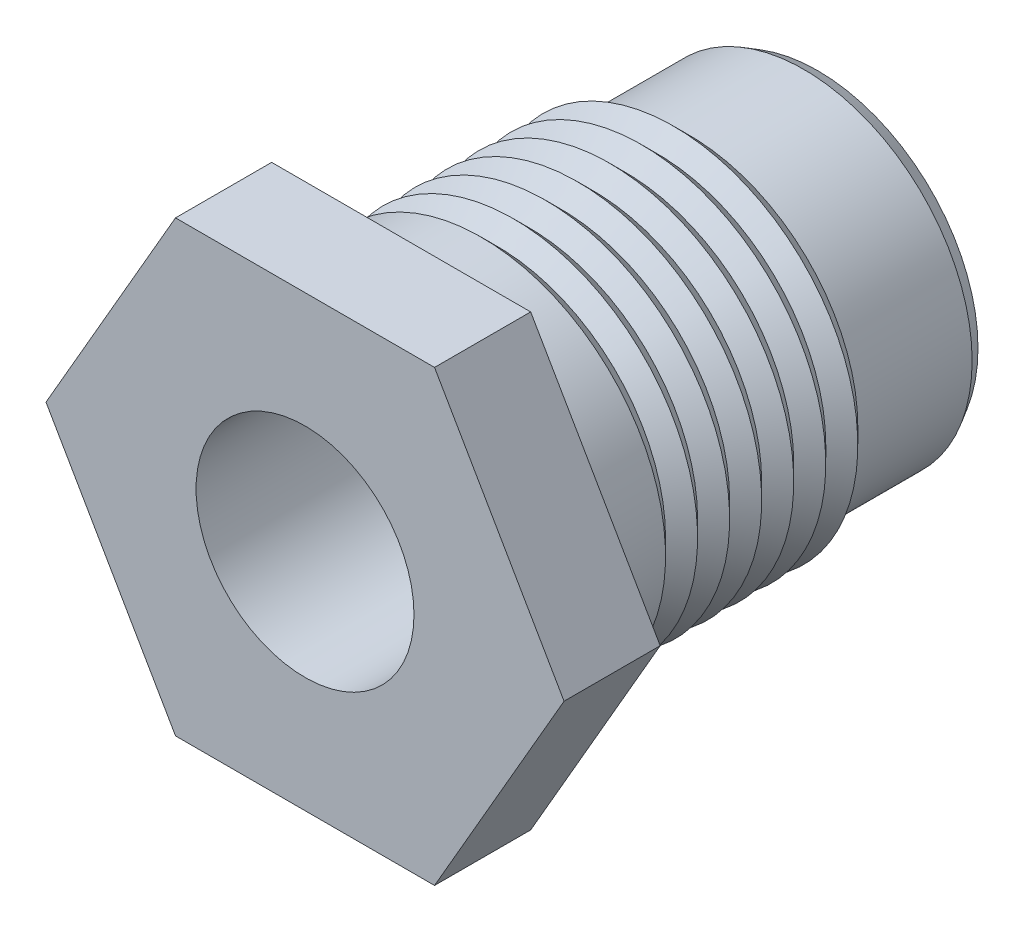
ISO-10303-21;
HEADER;
FILE_DESCRIPTION(('STEP AP214'),'2;1');
FILE_NAME('part.step','',(''),(''),'','','');
FILE_SCHEMA(('AUTOMOTIVE_DESIGN { 1 0 10303 214 1 1 1 1 }'));
ENDSEC;
DATA;
#1=APPLICATION_CONTEXT('core data for automotive mechanical design processes');
#2=APPLICATION_PROTOCOL_DEFINITION('international standard','automotive_design',2000,#1);
#3=PRODUCT_CONTEXT('',#1,'mechanical');
#4=PRODUCT('Part','Part','',(#3));
#5=PRODUCT_RELATED_PRODUCT_CATEGORY('part','',(#4));
#6=PRODUCT_DEFINITION_FORMATION('','',#4);
#7=PRODUCT_DEFINITION_CONTEXT('part definition',#1,'design');
#8=PRODUCT_DEFINITION('design','',#6,#7);
#9=PRODUCT_DEFINITION_SHAPE('','',#8);
#10=(LENGTH_UNIT() NAMED_UNIT(*) SI_UNIT(.MILLI.,.METRE.));
#11=(NAMED_UNIT(*) PLANE_ANGLE_UNIT() SI_UNIT($,.RADIAN.));
#12=(NAMED_UNIT(*) SI_UNIT($,.STERADIAN.) SOLID_ANGLE_UNIT());
#13=UNCERTAINTY_MEASURE_WITH_UNIT(LENGTH_MEASURE(1.E-05),#10,'distance_accuracy_value','');
#14=(GEOMETRIC_REPRESENTATION_CONTEXT(3) GLOBAL_UNCERTAINTY_ASSIGNED_CONTEXT((#13)) GLOBAL_UNIT_ASSIGNED_CONTEXT((#10,
#11,#12)) REPRESENTATION_CONTEXT('',''));
#15=CARTESIAN_POINT('',(0.,0.,0.));
#16=DIRECTION('',(0.,0.,1.));
#17=DIRECTION('',(1.,0.,0.));
#18=AXIS2_PLACEMENT_3D('',#15,#16,#17);
#19=CARTESIAN_POINT('',(0.,0.,0.));
#20=DIRECTION('',(0.,0.,-1.));
#21=DIRECTION('',(-1.,0.,0.));
#22=AXIS2_PLACEMENT_3D('',#19,#20,#21);
#23=CYLINDRICAL_SURFACE('',#22,5.75000000000002);
#24=CARTESIAN_POINT('',(0.,0.,12.6));
#25=DIRECTION('',(0.,0.,-1.));
#26=DIRECTION('',(-1.,0.,0.));
#27=AXIS2_PLACEMENT_3D('',#24,#25,#26);
#28=CIRCLE('',#27,5.75000000000003);
#29=CARTESIAN_POINT('',(-5.75000000000005,0.,12.6));
#30=VERTEX_POINT('',#29);
#31=EDGE_CURVE('E218',#30,#30,#28,.T.);
#32=ORIENTED_EDGE('',*,*,#31,.T.);
#33=EDGE_LOOP('',(#32));
#34=FACE_BOUND('',#33,.T.);
#35=CARTESIAN_POINT('',(0.,0.,10.5));
#36=DIRECTION('',(0.,0.,-1.));
#37=DIRECTION('',(-1.,0.,0.));
#38=AXIS2_PLACEMENT_3D('',#35,#36,#37);
#39=CIRCLE('',#38,5.75);
#40=CARTESIAN_POINT('',(-5.7499999999999,0.,10.4999999999999));
#41=VERTEX_POINT('',#40);
#42=EDGE_CURVE('E398',#41,#41,#39,.T.);
#43=ORIENTED_EDGE('',*,*,#42,.F.);
#44=EDGE_LOOP('',(#43));
#45=FACE_BOUND('',#44,.T.);
#46=ADVANCED_FACE('F45',(#34,#45),#23,.T.);
#47=CARTESIAN_POINT('',(0.,-14.,0.));
#48=DIRECTION('',(0.,0.,-1.));
#49=DIRECTION('',(-1.,0.,0.));
#50=AXIS2_PLACEMENT_3D('',#47,#48,#49);
#51=PLANE('',#50);
#52=CARTESIAN_POINT('',(0.,0.,0.));
#53=DIRECTION('',(0.,0.,1.));
#54=DIRECTION('',(1.,0.,0.));
#55=AXIS2_PLACEMENT_3D('',#52,#53,#54);
#56=CIRCLE('',#55,3.4);
#57=CARTESIAN_POINT('',(3.4,0.,0.));
#58=VERTEX_POINT('',#57);
#59=EDGE_CURVE('E141',#58,#58,#56,.T.);
#60=ORIENTED_EDGE('',*,*,#59,.T.);
#61=EDGE_LOOP('',(#60));
#62=FACE_BOUND('',#61,.T.);
#63=CARTESIAN_POINT('',(0.,0.,0.));
#64=DIRECTION('',(0.,0.,-1.));
#65=DIRECTION('',(-1.,0.,0.));
#66=AXIS2_PLACEMENT_3D('',#63,#64,#65);
#67=CIRCLE('',#66,5.);
#68=CARTESIAN_POINT('',(-5.,0.,0.));
#69=VERTEX_POINT('',#68);
#70=EDGE_CURVE('E212',#69,#69,#67,.T.);
#71=ORIENTED_EDGE('',*,*,#70,.T.);
#72=EDGE_LOOP('',(#71));
#73=FACE_BOUND('',#72,.T.);
#74=ADVANCED_FACE('F174',(#62,#73),#51,.T.);
#75=CARTESIAN_POINT('',(4.04145188432744,-6.99999999999998,16.));
#76=DIRECTION('',(-0.866025403784441,0.499999999999996,0.));
#77=DIRECTION('',(-0.499999999999997,-0.866025403784441,0.));
#78=AXIS2_PLACEMENT_3D('',#75,#76,#77);
#79=PLANE('',#78);
#80=DIRECTION('',(-0.499999999999997,-0.866025403784441,0.));
#81=VECTOR('',#80,1.);
#82=CARTESIAN_POINT('',(4.04145188432745,-6.99999999999998,13.));
#83=LINE('',#82,#81);
#84=CARTESIAN_POINT('',(8.08290376865477,0.,13.));
#85=VERTEX_POINT('',#84);
#86=CARTESIAN_POINT('',(4.04145188432744,-6.99999999999998,13.));
#87=VERTEX_POINT('',#86);
#88=EDGE_CURVE('E59',#85,#87,#83,.T.);
#89=ORIENTED_EDGE('',*,*,#88,.F.);
#90=DIRECTION('',(0.,0.,-1.));
#91=VECTOR('',#90,1.);
#92=CARTESIAN_POINT('',(8.08290376865477,0.,16.));
#93=LINE('',#92,#91);
#94=CARTESIAN_POINT('',(8.08290376865477,0.,16.));
#95=VERTEX_POINT('',#94);
#96=EDGE_CURVE('E53',#95,#85,#93,.T.);
#97=ORIENTED_EDGE('',*,*,#96,.F.);
#98=DIRECTION('',(0.499999999999996,0.866025403784441,0.));
#99=VECTOR('',#98,1.);
#100=CARTESIAN_POINT('',(4.04145188432744,-6.99999999999998,16.));
#101=LINE('',#100,#99);
#102=CARTESIAN_POINT('',(4.04145188432744,-6.99999999999998,16.));
#103=VERTEX_POINT('',#102);
#104=EDGE_CURVE('E140',#103,#95,#101,.T.);
#105=ORIENTED_EDGE('',*,*,#104,.F.);
#106=DIRECTION('',(0.,0.,-1.));
#107=VECTOR('',#106,1.);
#108=CARTESIAN_POINT('',(4.04145188432744,-6.99999999999998,16.));
#109=LINE('',#108,#107);
#110=EDGE_CURVE('E124',#103,#87,#109,.T.);
#111=ORIENTED_EDGE('',*,*,#110,.T.);
#112=EDGE_LOOP('',(#89,#97,#105,#111));
#113=FACE_BOUND('',#112,.T.);
#114=ADVANCED_FACE('F47',(#113),#79,.F.);
#115=CARTESIAN_POINT('',(8.08290376865477,0.,16.));
#116=DIRECTION('',(-0.866025403784436,-0.500000000000004,0.));
#117=DIRECTION('',(0.500000000000004,-0.866025403784436,0.));
#118=AXIS2_PLACEMENT_3D('',#115,#116,#117);
#119=PLANE('',#118);
#120=DIRECTION('',(0.500000000000004,-0.866025403784436,0.));
#121=VECTOR('',#120,1.);
#122=CARTESIAN_POINT('',(8.08290376865478,0.,13.));
#123=LINE('',#122,#121);
#124=CARTESIAN_POINT('',(4.0414518843274,7.00000000000002,13.));
#125=VERTEX_POINT('',#124);
#126=EDGE_CURVE('E135',#125,#85,#123,.T.);
#127=ORIENTED_EDGE('',*,*,#126,.F.);
#128=DIRECTION('',(0.,0.,-1.));
#129=VECTOR('',#128,1.);
#130=CARTESIAN_POINT('',(4.04145188432735,7.00000000000001,16.));
#131=LINE('',#130,#129);
#132=CARTESIAN_POINT('',(4.04145188432735,7.00000000000001,16.));
#133=VERTEX_POINT('',#132);
#134=EDGE_CURVE('E122',#133,#125,#131,.T.);
#135=ORIENTED_EDGE('',*,*,#134,.F.);
#136=DIRECTION('',(-0.500000000000004,0.866025403784436,0.));
#137=VECTOR('',#136,1.);
#138=CARTESIAN_POINT('',(8.08290376865477,0.,16.));
#139=LINE('',#138,#137);
#140=EDGE_CURVE('E136',#95,#133,#139,.T.);
#141=ORIENTED_EDGE('',*,*,#140,.F.);
#142=ORIENTED_EDGE('',*,*,#96,.T.);
#143=EDGE_LOOP('',(#127,#135,#141,#142));
#144=FACE_BOUND('',#143,.T.);
#145=ADVANCED_FACE('F133',(#144),#119,.F.);
#146=CARTESIAN_POINT('',(4.04145188432735,7.00000000000001,16.));
#147=DIRECTION('',(0.,-1.,0.));
#148=DIRECTION('',(1.,0.,0.));
#149=AXIS2_PLACEMENT_3D('',#146,#147,#148);
#150=PLANE('',#149);
#151=DIRECTION('',(1.,0.,0.));
#152=VECTOR('',#151,1.);
#153=CARTESIAN_POINT('',(4.04145188432735,7.00000000000001,13.));
#154=LINE('',#153,#152);
#155=CARTESIAN_POINT('',(-4.0414518843274,7.00000000000005,13.));
#156=VERTEX_POINT('',#155);
#157=EDGE_CURVE('E116',#156,#125,#154,.T.);
#158=ORIENTED_EDGE('',*,*,#157,.F.);
#159=DIRECTION('',(0.,0.,-1.));
#160=VECTOR('',#159,1.);
#161=CARTESIAN_POINT('',(-4.04145188432741,6.99999999999998,16.));
#162=LINE('',#161,#160);
#163=CARTESIAN_POINT('',(-4.04145188432741,6.99999999999998,16.));
#164=VERTEX_POINT('',#163);
#165=EDGE_CURVE('E115',#164,#156,#162,.T.);
#166=ORIENTED_EDGE('',*,*,#165,.F.);
#167=DIRECTION('',(-1.,0.,0.));
#168=VECTOR('',#167,1.);
#169=CARTESIAN_POINT('',(4.04145188432735,7.00000000000001,16.));
#170=LINE('',#169,#168);
#171=EDGE_CURVE('E153',#133,#164,#170,.T.);
#172=ORIENTED_EDGE('',*,*,#171,.F.);
#173=ORIENTED_EDGE('',*,*,#134,.T.);
#174=EDGE_LOOP('',(#158,#166,#172,#173));
#175=FACE_BOUND('',#174,.T.);
#176=ADVANCED_FACE('F231',(#175),#150,.F.);
#177=CARTESIAN_POINT('',(-4.04145188432741,6.99999999999998,16.));
#178=DIRECTION('',(0.866025403784441,-0.499999999999997,0.));
#179=DIRECTION('',(0.499999999999997,0.866025403784441,0.));
#180=AXIS2_PLACEMENT_3D('',#177,#178,#179);
#181=PLANE('',#180);
#182=DIRECTION('',(0.499999999999997,0.866025403784441,0.));
#183=VECTOR('',#182,1.);
#184=CARTESIAN_POINT('',(-4.04145188432741,6.99999999999998,13.));
#185=LINE('',#184,#183);
#186=CARTESIAN_POINT('',(-8.08290376865483,0.,13.));
#187=VERTEX_POINT('',#186);
#188=EDGE_CURVE('E99',#187,#156,#185,.T.);
#189=ORIENTED_EDGE('',*,*,#188,.F.);
#190=DIRECTION('',(0.,0.,-1.));
#191=VECTOR('',#190,1.);
#192=CARTESIAN_POINT('',(-8.08290376865476,0.,16.));
#193=LINE('',#192,#191);
#194=CARTESIAN_POINT('',(-8.08290376865476,0.,16.));
#195=VERTEX_POINT('',#194);
#196=EDGE_CURVE('E112',#195,#187,#193,.T.);
#197=ORIENTED_EDGE('',*,*,#196,.F.);
#198=DIRECTION('',(-0.499999999999997,-0.866025403784441,0.));
#199=VECTOR('',#198,1.);
#200=CARTESIAN_POINT('',(-4.04145188432741,6.99999999999998,16.));
#201=LINE('',#200,#199);
#202=EDGE_CURVE('E155',#164,#195,#201,.T.);
#203=ORIENTED_EDGE('',*,*,#202,.F.);
#204=ORIENTED_EDGE('',*,*,#165,.T.);
#205=EDGE_LOOP('',(#189,#197,#203,#204));
#206=FACE_BOUND('',#205,.T.);
#207=ADVANCED_FACE('F110',(#206),#181,.F.);
#208=CARTESIAN_POINT('',(-8.08290376865476,0.,16.));
#209=DIRECTION('',(0.866025403784436,0.500000000000004,0.));
#210=DIRECTION('',(-0.500000000000004,0.866025403784436,0.));
#211=AXIS2_PLACEMENT_3D('',#208,#209,#210);
#212=PLANE('',#211);
#213=DIRECTION('',(-0.500000000000004,0.866025403784436,0.));
#214=VECTOR('',#213,1.);
#215=CARTESIAN_POINT('',(-8.08290376865476,0.,13.));
#216=LINE('',#215,#214);
#217=CARTESIAN_POINT('',(-4.04145188432743,-7.00000000000003,13.));
#218=VERTEX_POINT('',#217);
#219=EDGE_CURVE('E96',#218,#187,#216,.T.);
#220=ORIENTED_EDGE('',*,*,#219,.F.);
#221=DIRECTION('',(0.,0.,-1.));
#222=VECTOR('',#221,1.);
#223=CARTESIAN_POINT('',(-4.04145188432735,-7.00000000000001,16.));
#224=LINE('',#223,#222);
#225=CARTESIAN_POINT('',(-4.04145188432735,-7.00000000000001,16.));
#226=VERTEX_POINT('',#225);
#227=EDGE_CURVE('E120',#226,#218,#224,.T.);
#228=ORIENTED_EDGE('',*,*,#227,.F.);
#229=DIRECTION('',(0.500000000000004,-0.866025403784436,0.));
#230=VECTOR('',#229,1.);
#231=CARTESIAN_POINT('',(-8.08290376865476,0.,16.));
#232=LINE('',#231,#230);
#233=EDGE_CURVE('E119',#195,#226,#232,.T.);
#234=ORIENTED_EDGE('',*,*,#233,.F.);
#235=ORIENTED_EDGE('',*,*,#196,.T.);
#236=EDGE_LOOP('',(#220,#228,#234,#235));
#237=FACE_BOUND('',#236,.T.);
#238=ADVANCED_FACE('F118',(#237),#212,.F.);
#239=CARTESIAN_POINT('',(-4.04145188432735,-7.00000000000001,16.));
#240=DIRECTION('',(0.,1.,0.));
#241=DIRECTION('',(-1.,0.,0.));
#242=AXIS2_PLACEMENT_3D('',#239,#240,#241);
#243=PLANE('',#242);
#244=DIRECTION('',(-1.,0.,0.));
#245=VECTOR('',#244,1.);
#246=CARTESIAN_POINT('',(-4.04145188432734,-7.00000000000001,13.));
#247=LINE('',#246,#245);
#248=EDGE_CURVE('E11',#87,#218,#247,.T.);
#249=ORIENTED_EDGE('',*,*,#248,.F.);
#250=ORIENTED_EDGE('',*,*,#110,.F.);
#251=DIRECTION('',(1.,0.,0.));
#252=VECTOR('',#251,1.);
#253=CARTESIAN_POINT('',(-4.04145188432735,-7.00000000000001,16.));
#254=LINE('',#253,#252);
#255=EDGE_CURVE('E67',#226,#103,#254,.T.);
#256=ORIENTED_EDGE('',*,*,#255,.F.);
#257=ORIENTED_EDGE('',*,*,#227,.T.);
#258=EDGE_LOOP('',(#249,#250,#256,#257));
#259=FACE_BOUND('',#258,.T.);
#260=ADVANCED_FACE('F161',(#259),#243,.F.);
#261=CARTESIAN_POINT('',(0.,-14.,16.));
#262=DIRECTION('',(0.,0.,-1.));
#263=DIRECTION('',(-1.,0.,0.));
#264=AXIS2_PLACEMENT_3D('',#261,#262,#263);
#265=PLANE('',#264);
#266=ORIENTED_EDGE('',*,*,#104,.T.);
#267=ORIENTED_EDGE('',*,*,#140,.T.);
#268=ORIENTED_EDGE('',*,*,#171,.T.);
#269=ORIENTED_EDGE('',*,*,#202,.T.);
#270=ORIENTED_EDGE('',*,*,#233,.T.);
#271=ORIENTED_EDGE('',*,*,#255,.T.);
#272=EDGE_LOOP('',(#266,#267,#268,#269,#270,#271));
#273=FACE_BOUND('',#272,.T.);
#274=CARTESIAN_POINT('',(0.,0.,16.));
#275=DIRECTION('',(0.,0.,1.));
#276=DIRECTION('',(1.,0.,0.));
#277=AXIS2_PLACEMENT_3D('',#274,#275,#276);
#278=CIRCLE('',#277,3.4);
#279=CARTESIAN_POINT('',(3.4,0.,16.));
#280=VERTEX_POINT('',#279);
#281=EDGE_CURVE('E144',#280,#280,#278,.T.);
#282=ORIENTED_EDGE('',*,*,#281,.F.);
#283=EDGE_LOOP('',(#282));
#284=FACE_BOUND('',#283,.T.);
#285=ADVANCED_FACE('F158',(#273,#284),#265,.F.);
#286=CARTESIAN_POINT('',(0.,0.,16.));
#287=DIRECTION('',(0.,0.,-1.));
#288=DIRECTION('',(-1.,0.,0.));
#289=AXIS2_PLACEMENT_3D('',#286,#287,#288);
#290=CYLINDRICAL_SURFACE('',#289,3.4);
#291=ORIENTED_EDGE('',*,*,#281,.T.);
#292=EDGE_LOOP('',(#291));
#293=FACE_BOUND('',#292,.T.);
#294=ORIENTED_EDGE('',*,*,#59,.F.);
#295=EDGE_LOOP('',(#294));
#296=FACE_BOUND('',#295,.T.);
#297=ADVANCED_FACE('F169',(#293,#296),#290,.F.);
#298=CARTESIAN_POINT('',(6.15,0.,13.));
#299=DIRECTION('',(0.,0.,-1.));
#300=DIRECTION('',(-1.,0.,0.));
#301=AXIS2_PLACEMENT_3D('',#298,#299,#300);
#302=PLANE('',#301);
#303=CARTESIAN_POINT('',(0.,0.,13.));
#304=DIRECTION('',(0.,0.,-1.));
#305=DIRECTION('',(-1.,0.,0.));
#306=AXIS2_PLACEMENT_3D('',#303,#304,#305);
#307=CIRCLE('',#306,6.15000000000003);
#308=CARTESIAN_POINT('',(-6.15000000000006,0.,13.));
#309=VERTEX_POINT('',#308);
#310=EDGE_CURVE('E214',#309,#309,#307,.T.);
#311=ORIENTED_EDGE('',*,*,#310,.F.);
#312=EDGE_LOOP('',(#311));
#313=FACE_BOUND('',#312,.T.);
#314=ORIENTED_EDGE('',*,*,#88,.T.);
#315=ORIENTED_EDGE('',*,*,#248,.T.);
#316=ORIENTED_EDGE('',*,*,#219,.T.);
#317=ORIENTED_EDGE('',*,*,#188,.T.);
#318=ORIENTED_EDGE('',*,*,#157,.T.);
#319=ORIENTED_EDGE('',*,*,#126,.T.);
#320=EDGE_LOOP('',(#314,#315,#316,#317,#318,#319));
#321=FACE_BOUND('',#320,.T.);
#322=ADVANCED_FACE('F98',(#313,#321),#302,.T.);
#323=CARTESIAN_POINT('',(0.,0.,0.));
#324=DIRECTION('',(0.,0.,1.));
#325=DIRECTION('',(1.,0.,0.));
#326=AXIS2_PLACEMENT_3D('',#323,#324,#325);
#327=CONICAL_SURFACE('',#326,5.,0.523598775598295);
#328=CARTESIAN_POINT('',(0.,0.,0.433012701892216));
#329=DIRECTION('',(0.,0.,-1.));
#330=DIRECTION('',(-1.,0.,0.));
#331=AXIS2_PLACEMENT_3D('',#328,#329,#330);
#332=CIRCLE('',#331,5.25);
#333=CARTESIAN_POINT('',(-5.25,0.,0.433012701892205));
#334=VERTEX_POINT('',#333);
#335=EDGE_CURVE('E105',#334,#334,#332,.T.);
#336=ORIENTED_EDGE('',*,*,#335,.T.);
#337=EDGE_LOOP('',(#336));
#338=FACE_BOUND('',#337,.T.);
#339=ORIENTED_EDGE('',*,*,#70,.F.);
#340=EDGE_LOOP('',(#339));
#341=FACE_BOUND('',#340,.T.);
#342=ADVANCED_FACE('F196',(#338,#341),#327,.T.);
#343=CARTESIAN_POINT('',(0.,0.,0.));
#344=DIRECTION('',(0.,0.,-1.));
#345=DIRECTION('',(-1.,0.,0.));
#346=AXIS2_PLACEMENT_3D('',#343,#344,#345);
#347=CYLINDRICAL_SURFACE('',#346,5.25000000000001);
#348=CARTESIAN_POINT('',(0.,0.,3.99999999999999));
#349=DIRECTION('',(0.,0.,-1.));
#350=DIRECTION('',(-1.,0.,0.));
#351=AXIS2_PLACEMENT_3D('',#348,#349,#350);
#352=CIRCLE('',#351,5.25000000000001);
#353=CARTESIAN_POINT('',(-5.25000000000002,0.,3.99999999999998));
#354=VERTEX_POINT('',#353);
#355=EDGE_CURVE('E226',#354,#354,#352,.T.);
#356=ORIENTED_EDGE('',*,*,#355,.T.);
#357=EDGE_LOOP('',(#356));
#358=FACE_BOUND('',#357,.T.);
#359=ORIENTED_EDGE('',*,*,#335,.F.);
#360=EDGE_LOOP('',(#359));
#361=FACE_BOUND('',#360,.T.);
#362=ADVANCED_FACE('F192',(#358,#361),#347,.T.);
#363=CARTESIAN_POINT('',(0.,0.,3.99999999999999));
#364=DIRECTION('',(0.,0.,1.));
#365=DIRECTION('',(1.,0.,0.));
#366=AXIS2_PLACEMENT_3D('',#363,#364,#365);
#367=CONICAL_SURFACE('',#366,5.25000000000001,0.785398163397453);
#368=CARTESIAN_POINT('',(0.,0.,4.49999999999996));
#369=DIRECTION('',(0.,0.,-1.));
#370=DIRECTION('',(-1.,0.,0.));
#371=AXIS2_PLACEMENT_3D('',#368,#369,#370);
#372=CIRCLE('',#371,5.75);
#373=CARTESIAN_POINT('',(-5.75000000000001,0.,4.49999999999995));
#374=VERTEX_POINT('',#373);
#375=EDGE_CURVE('E221',#374,#374,#372,.T.);
#376=ORIENTED_EDGE('',*,*,#375,.T.);
#377=EDGE_LOOP('',(#376));
#378=FACE_BOUND('',#377,.T.);
#379=ORIENTED_EDGE('',*,*,#355,.F.);
#380=EDGE_LOOP('',(#379));
#381=FACE_BOUND('',#380,.T.);
#382=ADVANCED_FACE('F189',(#378,#381),#367,.T.);
#383=CARTESIAN_POINT('',(0.,0.,12.6));
#384=DIRECTION('',(0.,0.,-1.));
#385=DIRECTION('',(-1.,0.,0.));
#386=AXIS2_PLACEMENT_3D('',#383,#384,#385);
#387=TOROIDAL_SURFACE('',#386,6.15000000000003,0.4);
#388=ORIENTED_EDGE('',*,*,#310,.T.);
#389=EDGE_LOOP('',(#388));
#390=FACE_BOUND('',#389,.T.);
#391=ORIENTED_EDGE('',*,*,#31,.F.);
#392=EDGE_LOOP('',(#391));
#393=FACE_BOUND('',#392,.T.);
#394=ADVANCED_FACE('F187',(#390,#393),#387,.F.);
#395=CARTESIAN_POINT('',(0.,0.,4.49999999999996));
#396=DIRECTION('',(0.,0.,-1.));
#397=DIRECTION('',(-1.,0.,0.));
#398=AXIS2_PLACEMENT_3D('',#395,#396,#397);
#399=CONICAL_SURFACE('',#398,5.75,0.785398163397447);
#400=CARTESIAN_POINT('',(0.,0.,4.99999999999996));
#401=DIRECTION('',(0.,0.,-1.));
#402=DIRECTION('',(-1.,0.,0.));
#403=AXIS2_PLACEMENT_3D('',#400,#401,#402);
#404=CIRCLE('',#403,5.25);
#405=CARTESIAN_POINT('',(-5.25000000000001,0.,4.99999999999995));
#406=VERTEX_POINT('',#405);
#407=EDGE_CURVE('E215',#406,#406,#404,.T.);
#408=ORIENTED_EDGE('',*,*,#407,.T.);
#409=EDGE_LOOP('',(#408));
#410=FACE_BOUND('',#409,.T.);
#411=ORIENTED_EDGE('',*,*,#375,.F.);
#412=EDGE_LOOP('',(#411));
#413=FACE_BOUND('',#412,.T.);
#414=ADVANCED_FACE('F298',(#410,#413),#399,.T.);
#415=CARTESIAN_POINT('',(0.,0.,4.99999999999996));
#416=DIRECTION('',(0.,0.,1.));
#417=DIRECTION('',(1.,0.,0.));
#418=AXIS2_PLACEMENT_3D('',#415,#416,#417);
#419=CONICAL_SURFACE('',#418,5.25,0.785398163397453);
#420=CARTESIAN_POINT('',(0.,0.,5.49999999999996));
#421=DIRECTION('',(0.,0.,-1.));
#422=DIRECTION('',(-1.,0.,0.));
#423=AXIS2_PLACEMENT_3D('',#420,#421,#422);
#424=CIRCLE('',#423,5.75);
#425=CARTESIAN_POINT('',(-5.74999999999999,0.,5.49999999999995));
#426=VERTEX_POINT('',#425);
#427=EDGE_CURVE('E425',#426,#426,#424,.T.);
#428=ORIENTED_EDGE('',*,*,#427,.T.);
#429=EDGE_LOOP('',(#428));
#430=FACE_BOUND('',#429,.T.);
#431=ORIENTED_EDGE('',*,*,#407,.F.);
#432=EDGE_LOOP('',(#431));
#433=FACE_BOUND('',#432,.T.);
#434=ADVANCED_FACE('F305',(#430,#433),#419,.T.);
#435=CARTESIAN_POINT('',(0.,0.,5.49999999999996));
#436=DIRECTION('',(0.,0.,-1.));
#437=DIRECTION('',(-1.,0.,0.));
#438=AXIS2_PLACEMENT_3D('',#435,#436,#437);
#439=CONICAL_SURFACE('',#438,5.75,0.785398163397447);
#440=CARTESIAN_POINT('',(0.,0.,5.99999999999996));
#441=DIRECTION('',(0.,0.,-1.));
#442=DIRECTION('',(-1.,0.,0.));
#443=AXIS2_PLACEMENT_3D('',#440,#441,#442);
#444=CIRCLE('',#443,5.25);
#445=CARTESIAN_POINT('',(-5.24999999999999,0.,5.99999999999995));
#446=VERTEX_POINT('',#445);
#447=EDGE_CURVE('E428',#446,#446,#444,.T.);
#448=ORIENTED_EDGE('',*,*,#447,.T.);
#449=EDGE_LOOP('',(#448));
#450=FACE_BOUND('',#449,.T.);
#451=ORIENTED_EDGE('',*,*,#427,.F.);
#452=EDGE_LOOP('',(#451));
#453=FACE_BOUND('',#452,.T.);
#454=ADVANCED_FACE('F311',(#450,#453),#439,.T.);
#455=CARTESIAN_POINT('',(0.,0.,5.99999999999996));
#456=DIRECTION('',(0.,0.,1.));
#457=DIRECTION('',(1.,0.,0.));
#458=AXIS2_PLACEMENT_3D('',#455,#456,#457);
#459=CONICAL_SURFACE('',#458,5.25,0.785398163397453);
#460=CARTESIAN_POINT('',(0.,0.,6.49999999999996));
#461=DIRECTION('',(0.,0.,-1.));
#462=DIRECTION('',(-1.,0.,0.));
#463=AXIS2_PLACEMENT_3D('',#460,#461,#462);
#464=CIRCLE('',#463,5.75);
#465=CARTESIAN_POINT('',(-5.74999999999997,0.,6.49999999999995));
#466=VERTEX_POINT('',#465);
#467=EDGE_CURVE('E419',#466,#466,#464,.T.);
#468=ORIENTED_EDGE('',*,*,#467,.T.);
#469=EDGE_LOOP('',(#468));
#470=FACE_BOUND('',#469,.T.);
#471=ORIENTED_EDGE('',*,*,#447,.F.);
#472=EDGE_LOOP('',(#471));
#473=FACE_BOUND('',#472,.T.);
#474=ADVANCED_FACE('F321',(#470,#473),#459,.T.);
#475=CARTESIAN_POINT('',(0.,0.,6.49999999999996));
#476=DIRECTION('',(0.,0.,-1.));
#477=DIRECTION('',(-1.,0.,0.));
#478=AXIS2_PLACEMENT_3D('',#475,#476,#477);
#479=CONICAL_SURFACE('',#478,5.75,0.785398163397447);
#480=CARTESIAN_POINT('',(0.,0.,6.99999999999996));
#481=DIRECTION('',(0.,0.,-1.));
#482=DIRECTION('',(-1.,0.,0.));
#483=AXIS2_PLACEMENT_3D('',#480,#481,#482);
#484=CIRCLE('',#483,5.25);
#485=CARTESIAN_POINT('',(-5.24999999999997,0.,6.99999999999995));
#486=VERTEX_POINT('',#485);
#487=EDGE_CURVE('E422',#486,#486,#484,.T.);
#488=ORIENTED_EDGE('',*,*,#487,.T.);
#489=EDGE_LOOP('',(#488));
#490=FACE_BOUND('',#489,.T.);
#491=ORIENTED_EDGE('',*,*,#467,.F.);
#492=EDGE_LOOP('',(#491));
#493=FACE_BOUND('',#492,.T.);
#494=ADVANCED_FACE('F329',(#490,#493),#479,.T.);
#495=CARTESIAN_POINT('',(0.,0.,6.99999999999996));
#496=DIRECTION('',(0.,0.,1.));
#497=DIRECTION('',(1.,0.,0.));
#498=AXIS2_PLACEMENT_3D('',#495,#496,#497);
#499=CONICAL_SURFACE('',#498,5.25,0.785398163397453);
#500=CARTESIAN_POINT('',(0.,0.,7.49999999999996));
#501=DIRECTION('',(0.,0.,-1.));
#502=DIRECTION('',(-1.,0.,0.));
#503=AXIS2_PLACEMENT_3D('',#500,#501,#502);
#504=CIRCLE('',#503,5.75);
#505=CARTESIAN_POINT('',(-5.74999999999995,0.,7.49999999999995));
#506=VERTEX_POINT('',#505);
#507=EDGE_CURVE('E413',#506,#506,#504,.T.);
#508=ORIENTED_EDGE('',*,*,#507,.T.);
#509=EDGE_LOOP('',(#508));
#510=FACE_BOUND('',#509,.T.);
#511=ORIENTED_EDGE('',*,*,#487,.F.);
#512=EDGE_LOOP('',(#511));
#513=FACE_BOUND('',#512,.T.);
#514=ADVANCED_FACE('F337',(#510,#513),#499,.T.);
#515=CARTESIAN_POINT('',(0.,0.,7.49999999999996));
#516=DIRECTION('',(0.,0.,-1.));
#517=DIRECTION('',(-1.,0.,0.));
#518=AXIS2_PLACEMENT_3D('',#515,#516,#517);
#519=CONICAL_SURFACE('',#518,5.75,0.785398163397447);
#520=CARTESIAN_POINT('',(0.,0.,7.99999999999996));
#521=DIRECTION('',(0.,0.,-1.));
#522=DIRECTION('',(-1.,0.,0.));
#523=AXIS2_PLACEMENT_3D('',#520,#521,#522);
#524=CIRCLE('',#523,5.25);
#525=CARTESIAN_POINT('',(-5.24999999999995,0.,7.99999999999995));
#526=VERTEX_POINT('',#525);
#527=EDGE_CURVE('E416',#526,#526,#524,.T.);
#528=ORIENTED_EDGE('',*,*,#527,.T.);
#529=EDGE_LOOP('',(#528));
#530=FACE_BOUND('',#529,.T.);
#531=ORIENTED_EDGE('',*,*,#507,.F.);
#532=EDGE_LOOP('',(#531));
#533=FACE_BOUND('',#532,.T.);
#534=ADVANCED_FACE('F345',(#530,#533),#519,.T.);
#535=CARTESIAN_POINT('',(0.,0.,7.99999999999996));
#536=DIRECTION('',(0.,0.,1.));
#537=DIRECTION('',(1.,0.,0.));
#538=AXIS2_PLACEMENT_3D('',#535,#536,#537);
#539=CONICAL_SURFACE('',#538,5.25,0.785398163397453);
#540=CARTESIAN_POINT('',(0.,0.,8.49999999999996));
#541=DIRECTION('',(0.,0.,-1.));
#542=DIRECTION('',(-1.,0.,0.));
#543=AXIS2_PLACEMENT_3D('',#540,#541,#542);
#544=CIRCLE('',#543,5.75);
#545=CARTESIAN_POINT('',(-5.74999999999992,0.,8.49999999999995));
#546=VERTEX_POINT('',#545);
#547=EDGE_CURVE('E402',#546,#546,#544,.T.);
#548=ORIENTED_EDGE('',*,*,#547,.T.);
#549=EDGE_LOOP('',(#548));
#550=FACE_BOUND('',#549,.T.);
#551=ORIENTED_EDGE('',*,*,#527,.F.);
#552=EDGE_LOOP('',(#551));
#553=FACE_BOUND('',#552,.T.);
#554=ADVANCED_FACE('F353',(#550,#553),#539,.T.);
#555=CARTESIAN_POINT('',(0.,0.,8.49999999999996));
#556=DIRECTION('',(0.,0.,-1.));
#557=DIRECTION('',(-1.,0.,0.));
#558=AXIS2_PLACEMENT_3D('',#555,#556,#557);
#559=CONICAL_SURFACE('',#558,5.75,0.785398163397447);
#560=CARTESIAN_POINT('',(0.,0.,8.99999999999996));
#561=DIRECTION('',(0.,0.,-1.));
#562=DIRECTION('',(-1.,0.,0.));
#563=AXIS2_PLACEMENT_3D('',#560,#561,#562);
#564=CIRCLE('',#563,5.25);
#565=CARTESIAN_POINT('',(-5.24999999999993,0.,8.99999999999995));
#566=VERTEX_POINT('',#565);
#567=EDGE_CURVE('E405',#566,#566,#564,.T.);
#568=ORIENTED_EDGE('',*,*,#567,.T.);
#569=EDGE_LOOP('',(#568));
#570=FACE_BOUND('',#569,.T.);
#571=ORIENTED_EDGE('',*,*,#547,.F.);
#572=EDGE_LOOP('',(#571));
#573=FACE_BOUND('',#572,.T.);
#574=ADVANCED_FACE('F361',(#570,#573),#559,.T.);
#575=CARTESIAN_POINT('',(0.,0.,8.99999999999996));
#576=DIRECTION('',(0.,0.,1.));
#577=DIRECTION('',(1.,0.,0.));
#578=AXIS2_PLACEMENT_3D('',#575,#576,#577);
#579=CONICAL_SURFACE('',#578,5.25,0.785398163397453);
#580=CARTESIAN_POINT('',(1.00595891570446E-13,0.,9.49999999999996));
#581=DIRECTION('',(0.,0.,-1.));
#582=DIRECTION('',(-1.,0.,0.));
#583=AXIS2_PLACEMENT_3D('',#580,#581,#582);
#584=CIRCLE('',#583,5.75);
#585=CARTESIAN_POINT('',(-5.7499999999999,0.,9.49999999999995));
#586=VERTEX_POINT('',#585);
#587=EDGE_CURVE('E407',#586,#586,#584,.T.);
#588=ORIENTED_EDGE('',*,*,#587,.T.);
#589=EDGE_LOOP('',(#588));
#590=FACE_BOUND('',#589,.T.);
#591=ORIENTED_EDGE('',*,*,#567,.F.);
#592=EDGE_LOOP('',(#591));
#593=FACE_BOUND('',#592,.T.);
#594=ADVANCED_FACE('F369',(#590,#593),#579,.T.);
#595=CARTESIAN_POINT('',(1.00595891570446E-13,0.,9.49999999999996));
#596=DIRECTION('',(0.,0.,-1.));
#597=DIRECTION('',(-1.,0.,0.));
#598=AXIS2_PLACEMENT_3D('',#595,#596,#597);
#599=CONICAL_SURFACE('',#598,5.75,0.785398163397447);
#600=CARTESIAN_POINT('',(0.,0.,9.99999999999996));
#601=DIRECTION('',(0.,0.,-1.));
#602=DIRECTION('',(-1.,0.,0.));
#603=AXIS2_PLACEMENT_3D('',#600,#601,#602);
#604=CIRCLE('',#603,5.25);
#605=CARTESIAN_POINT('',(-5.2499999999999,0.,9.99999999999995));
#606=VERTEX_POINT('',#605);
#607=EDGE_CURVE('E401',#606,#606,#604,.T.);
#608=ORIENTED_EDGE('',*,*,#607,.T.);
#609=EDGE_LOOP('',(#608));
#610=FACE_BOUND('',#609,.T.);
#611=ORIENTED_EDGE('',*,*,#587,.F.);
#612=EDGE_LOOP('',(#611));
#613=FACE_BOUND('',#612,.T.);
#614=ADVANCED_FACE('F377',(#610,#613),#599,.T.);
#615=CARTESIAN_POINT('',(0.,0.,9.99999999999996));
#616=DIRECTION('',(0.,0.,1.));
#617=DIRECTION('',(1.,0.,0.));
#618=AXIS2_PLACEMENT_3D('',#615,#616,#617);
#619=CONICAL_SURFACE('',#618,5.25,0.785398163397453);
#620=ORIENTED_EDGE('',*,*,#42,.T.);
#621=EDGE_LOOP('',(#620));
#622=FACE_BOUND('',#621,.T.);
#623=ORIENTED_EDGE('',*,*,#607,.F.);
#624=EDGE_LOOP('',(#623));
#625=FACE_BOUND('',#624,.T.);
#626=ADVANCED_FACE('F385',(#622,#625),#619,.T.);
#627=CLOSED_SHELL('',(#46,#74,#114,#145,#176,#207,#238,#260,#285,#297,#322,#342,#362,#382,#394,
#414,#434,#454,#474,#494,#514,#534,#554,#574,#594,#614,#626));
#628=MANIFOLD_SOLID_BREP('B2',#627);
#629=ADVANCED_BREP_SHAPE_REPRESENTATION('',(#18,#628),#14);
#630=SHAPE_DEFINITION_REPRESENTATION(#9,#629);
ENDSEC;
END-ISO-10303-21;
